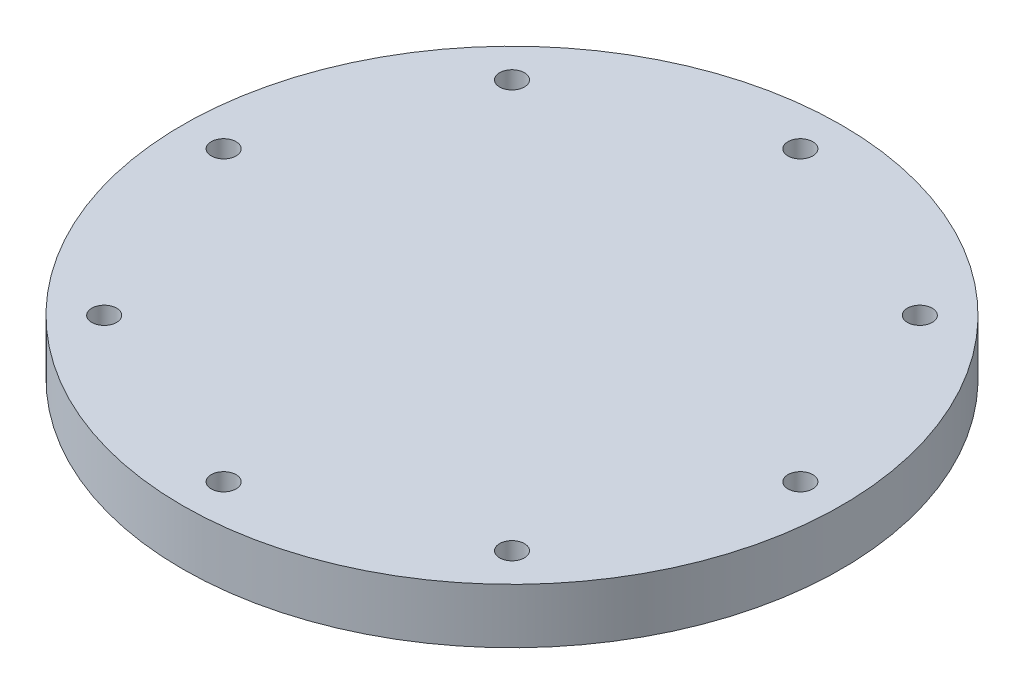
ISO-10303-21;
HEADER;
FILE_DESCRIPTION(('STEP AP214'),'2;1');
FILE_NAME('part.step','',(''),(''),'','','');
FILE_SCHEMA(('AUTOMOTIVE_DESIGN { 1 0 10303 214 1 1 1 1 }'));
ENDSEC;
DATA;
#1=APPLICATION_CONTEXT('core data for automotive mechanical design processes');
#2=APPLICATION_PROTOCOL_DEFINITION('international standard','automotive_design',2000,#1);
#3=PRODUCT_CONTEXT('',#1,'mechanical');
#4=PRODUCT('Part','Part','',(#3));
#5=PRODUCT_RELATED_PRODUCT_CATEGORY('part','',(#4));
#6=PRODUCT_DEFINITION_FORMATION('','',#4);
#7=PRODUCT_DEFINITION_CONTEXT('part definition',#1,'design');
#8=PRODUCT_DEFINITION('design','',#6,#7);
#9=PRODUCT_DEFINITION_SHAPE('','',#8);
#10=(LENGTH_UNIT() NAMED_UNIT(*) SI_UNIT(.MILLI.,.METRE.));
#11=(NAMED_UNIT(*) PLANE_ANGLE_UNIT() SI_UNIT($,.RADIAN.));
#12=(NAMED_UNIT(*) SI_UNIT($,.STERADIAN.) SOLID_ANGLE_UNIT());
#13=UNCERTAINTY_MEASURE_WITH_UNIT(LENGTH_MEASURE(1.E-05),#10,'distance_accuracy_value','');
#14=(GEOMETRIC_REPRESENTATION_CONTEXT(3) GLOBAL_UNCERTAINTY_ASSIGNED_CONTEXT((#13)) GLOBAL_UNIT_ASSIGNED_CONTEXT((#10,
#11,#12)) REPRESENTATION_CONTEXT('',''));
#15=CARTESIAN_POINT('',(0.,0.,0.));
#16=DIRECTION('',(0.,0.,1.));
#17=DIRECTION('',(1.,0.,0.));
#18=AXIS2_PLACEMENT_3D('',#15,#16,#17);
#19=CARTESIAN_POINT('',(0.,6.35,0.));
#20=DIRECTION('',(0.,1.,0.));
#21=DIRECTION('',(0.,0.,1.));
#22=AXIS2_PLACEMENT_3D('',#19,#20,#21);
#23=PLANE('',#22);
#24=CARTESIAN_POINT('',(0.,6.35,0.));
#25=DIRECTION('',(0.,1.,0.));
#26=DIRECTION('',(0.,0.,1.));
#27=AXIS2_PLACEMENT_3D('',#24,#25,#26);
#28=CIRCLE('',#27,38.1);
#29=CARTESIAN_POINT('',(0.,6.35,38.1));
#30=VERTEX_POINT('',#29);
#31=EDGE_CURVE('E10',#30,#30,#28,.T.);
#32=ORIENTED_EDGE('',*,*,#31,.T.);
#33=EDGE_LOOP('',(#32));
#34=FACE_BOUND('',#33,.T.);
#35=CARTESIAN_POINT('',(0.,6.35,33.3375));
#36=DIRECTION('',(0.,-1.,0.));
#37=DIRECTION('',(0.,0.,-1.));
#38=AXIS2_PLACEMENT_3D('',#35,#36,#37);
#39=CIRCLE('',#38,1.4351);
#40=CARTESIAN_POINT('',(0.,6.35,31.9024));
#41=VERTEX_POINT('',#40);
#42=EDGE_CURVE('E46',#41,#41,#39,.T.);
#43=ORIENTED_EDGE('',*,*,#42,.T.);
#44=EDGE_LOOP('',(#43));
#45=FACE_BOUND('',#44,.T.);
#46=CARTESIAN_POINT('',(23.5731723178066,6.35,23.5731723178065));
#47=DIRECTION('',(0.,-1.,0.));
#48=DIRECTION('',(0.,0.,-1.));
#49=AXIS2_PLACEMENT_3D('',#46,#47,#48);
#50=CIRCLE('',#49,1.4351);
#51=CARTESIAN_POINT('',(23.5731723178066,6.35,22.1380723178065));
#52=VERTEX_POINT('',#51);
#53=EDGE_CURVE('E59',#52,#52,#50,.T.);
#54=ORIENTED_EDGE('',*,*,#53,.T.);
#55=EDGE_LOOP('',(#54));
#56=FACE_BOUND('',#55,.T.);
#57=CARTESIAN_POINT('',(33.3375,6.35,-1.16397259133683E-13));
#58=DIRECTION('',(0.,-1.,0.));
#59=DIRECTION('',(0.,0.,-1.));
#60=AXIS2_PLACEMENT_3D('',#57,#58,#59);
#61=CIRCLE('',#60,1.4351);
#62=CARTESIAN_POINT('',(33.3375,6.35,-1.43510000000012));
#63=VERTEX_POINT('',#62);
#64=EDGE_CURVE('E71',#63,#63,#61,.T.);
#65=ORIENTED_EDGE('',*,*,#64,.T.);
#66=EDGE_LOOP('',(#65));
#67=FACE_BOUND('',#66,.T.);
#68=CARTESIAN_POINT('',(23.5731723178064,6.35,-23.5731723178067));
#69=DIRECTION('',(0.,-1.,0.));
#70=DIRECTION('',(0.,0.,-1.));
#71=AXIS2_PLACEMENT_3D('',#68,#69,#70);
#72=CIRCLE('',#71,1.4351);
#73=CARTESIAN_POINT('',(23.5731723178064,6.35,-25.0082723178067));
#74=VERTEX_POINT('',#73);
#75=EDGE_CURVE('E83',#74,#74,#72,.T.);
#76=ORIENTED_EDGE('',*,*,#75,.T.);
#77=EDGE_LOOP('',(#76));
#78=FACE_BOUND('',#77,.T.);
#79=CARTESIAN_POINT('',(0.,6.35,-33.3375));
#80=DIRECTION('',(0.,-1.,0.));
#81=DIRECTION('',(0.,0.,-1.));
#82=AXIS2_PLACEMENT_3D('',#79,#80,#81);
#83=CIRCLE('',#82,1.4351);
#84=CARTESIAN_POINT('',(0.,6.35,-34.7726));
#85=VERTEX_POINT('',#84);
#86=EDGE_CURVE('E95',#85,#85,#83,.T.);
#87=ORIENTED_EDGE('',*,*,#86,.T.);
#88=EDGE_LOOP('',(#87));
#89=FACE_BOUND('',#88,.T.);
#90=CARTESIAN_POINT('',(-23.5731723178067,6.35,-23.5731723178063));
#91=DIRECTION('',(0.,-1.,0.));
#92=DIRECTION('',(0.,0.,-1.));
#93=AXIS2_PLACEMENT_3D('',#90,#91,#92);
#94=CIRCLE('',#93,1.4351);
#95=CARTESIAN_POINT('',(-23.5731723178067,6.35,-25.0082723178063));
#96=VERTEX_POINT('',#95);
#97=EDGE_CURVE('E107',#96,#96,#94,.T.);
#98=ORIENTED_EDGE('',*,*,#97,.T.);
#99=EDGE_LOOP('',(#98));
#100=FACE_BOUND('',#99,.T.);
#101=CARTESIAN_POINT('',(-33.3375,6.35,3.49191777401049E-13));
#102=DIRECTION('',(0.,-1.,0.));
#103=DIRECTION('',(0.,0.,-1.));
#104=AXIS2_PLACEMENT_3D('',#101,#102,#103);
#105=CIRCLE('',#104,1.4351);
#106=CARTESIAN_POINT('',(-33.3375,6.35,-1.43509999999965));
#107=VERTEX_POINT('',#106);
#108=EDGE_CURVE('E119',#107,#107,#105,.T.);
#109=ORIENTED_EDGE('',*,*,#108,.T.);
#110=EDGE_LOOP('',(#109));
#111=FACE_BOUND('',#110,.T.);
#112=CARTESIAN_POINT('',(-23.5731723178062,6.35,23.5731723178068));
#113=DIRECTION('',(0.,-1.,0.));
#114=DIRECTION('',(0.,0.,-1.));
#115=AXIS2_PLACEMENT_3D('',#112,#113,#114);
#116=CIRCLE('',#115,1.4351);
#117=CARTESIAN_POINT('',(-23.5731723178062,6.35,22.1380723178068));
#118=VERTEX_POINT('',#117);
#119=EDGE_CURVE('E131',#118,#118,#116,.T.);
#120=ORIENTED_EDGE('',*,*,#119,.T.);
#121=EDGE_LOOP('',(#120));
#122=FACE_BOUND('',#121,.T.);
#123=ADVANCED_FACE('F35',(#34,#45,#56,#67,#78,#89,#100,#111,#122),#23,.T.);
#124=CARTESIAN_POINT('',(0.,0.,0.));
#125=DIRECTION('',(0.,1.,0.));
#126=DIRECTION('',(0.,0.,1.));
#127=AXIS2_PLACEMENT_3D('',#124,#125,#126);
#128=PLANE('',#127);
#129=CARTESIAN_POINT('',(-23.5731723178062,0.,23.5731723178068));
#130=DIRECTION('',(0.,-1.,0.));
#131=DIRECTION('',(0.,0.,-1.));
#132=AXIS2_PLACEMENT_3D('',#129,#130,#131);
#133=CIRCLE('',#132,2.413);
#134=CARTESIAN_POINT('',(-23.5731723178062,0.,21.1601723178068));
#135=VERTEX_POINT('',#134);
#136=EDGE_CURVE('E140',#135,#135,#133,.T.);
#137=ORIENTED_EDGE('',*,*,#136,.F.);
#138=EDGE_LOOP('',(#137));
#139=FACE_BOUND('',#138,.T.);
#140=CARTESIAN_POINT('',(-33.3375,0.,3.49191777401049E-13));
#141=DIRECTION('',(0.,-1.,0.));
#142=DIRECTION('',(0.,0.,-1.));
#143=AXIS2_PLACEMENT_3D('',#140,#141,#142);
#144=CIRCLE('',#143,2.413);
#145=CARTESIAN_POINT('',(-33.3375,0.,-2.41299999999965));
#146=VERTEX_POINT('',#145);
#147=EDGE_CURVE('E128',#146,#146,#144,.T.);
#148=ORIENTED_EDGE('',*,*,#147,.F.);
#149=EDGE_LOOP('',(#148));
#150=FACE_BOUND('',#149,.T.);
#151=CARTESIAN_POINT('',(-23.5731723178067,0.,-23.5731723178063));
#152=DIRECTION('',(0.,-1.,0.));
#153=DIRECTION('',(0.,0.,-1.));
#154=AXIS2_PLACEMENT_3D('',#151,#152,#153);
#155=CIRCLE('',#154,2.413);
#156=CARTESIAN_POINT('',(-23.5731723178067,0.,-25.9861723178063));
#157=VERTEX_POINT('',#156);
#158=EDGE_CURVE('E116',#157,#157,#155,.T.);
#159=ORIENTED_EDGE('',*,*,#158,.F.);
#160=EDGE_LOOP('',(#159));
#161=FACE_BOUND('',#160,.T.);
#162=CARTESIAN_POINT('',(23.5731723178064,0.,-23.5731723178067));
#163=DIRECTION('',(0.,-1.,0.));
#164=DIRECTION('',(0.,0.,-1.));
#165=AXIS2_PLACEMENT_3D('',#162,#163,#164);
#166=CIRCLE('',#165,2.413);
#167=CARTESIAN_POINT('',(23.5731723178064,0.,-25.9861723178067));
#168=VERTEX_POINT('',#167);
#169=EDGE_CURVE('E92',#168,#168,#166,.T.);
#170=ORIENTED_EDGE('',*,*,#169,.F.);
#171=EDGE_LOOP('',(#170));
#172=FACE_BOUND('',#171,.T.);
#173=CARTESIAN_POINT('',(33.3375,0.,-1.16397259133683E-13));
#174=DIRECTION('',(0.,-1.,0.));
#175=DIRECTION('',(0.,0.,-1.));
#176=AXIS2_PLACEMENT_3D('',#173,#174,#175);
#177=CIRCLE('',#176,2.413);
#178=CARTESIAN_POINT('',(33.3375,0.,-2.41300000000011));
#179=VERTEX_POINT('',#178);
#180=EDGE_CURVE('E80',#179,#179,#177,.T.);
#181=ORIENTED_EDGE('',*,*,#180,.F.);
#182=EDGE_LOOP('',(#181));
#183=FACE_BOUND('',#182,.T.);
#184=CARTESIAN_POINT('',(23.5731723178066,0.,23.5731723178065));
#185=DIRECTION('',(0.,-1.,0.));
#186=DIRECTION('',(0.,0.,-1.));
#187=AXIS2_PLACEMENT_3D('',#184,#185,#186);
#188=CIRCLE('',#187,2.413);
#189=CARTESIAN_POINT('',(23.5731723178066,0.,21.1601723178065));
#190=VERTEX_POINT('',#189);
#191=EDGE_CURVE('E68',#190,#190,#188,.T.);
#192=ORIENTED_EDGE('',*,*,#191,.F.);
#193=EDGE_LOOP('',(#192));
#194=FACE_BOUND('',#193,.T.);
#195=CARTESIAN_POINT('',(0.,0.,33.3375));
#196=DIRECTION('',(0.,-1.,0.));
#197=DIRECTION('',(0.,0.,-1.));
#198=AXIS2_PLACEMENT_3D('',#195,#196,#197);
#199=CIRCLE('',#198,2.413);
#200=CARTESIAN_POINT('',(0.,0.,30.9245));
#201=VERTEX_POINT('',#200);
#202=EDGE_CURVE('E56',#201,#201,#199,.T.);
#203=ORIENTED_EDGE('',*,*,#202,.F.);
#204=EDGE_LOOP('',(#203));
#205=FACE_BOUND('',#204,.T.);
#206=CARTESIAN_POINT('',(0.,0.,0.));
#207=DIRECTION('',(0.,1.,0.));
#208=DIRECTION('',(0.,0.,1.));
#209=AXIS2_PLACEMENT_3D('',#206,#207,#208);
#210=CIRCLE('',#209,38.1);
#211=CARTESIAN_POINT('',(0.,0.,38.1));
#212=VERTEX_POINT('',#211);
#213=EDGE_CURVE('E39',#212,#212,#210,.T.);
#214=ORIENTED_EDGE('',*,*,#213,.F.);
#215=EDGE_LOOP('',(#214));
#216=FACE_BOUND('',#215,.T.);
#217=CARTESIAN_POINT('',(0.,0.,-33.3375));
#218=DIRECTION('',(0.,-1.,0.));
#219=DIRECTION('',(0.,0.,-1.));
#220=AXIS2_PLACEMENT_3D('',#217,#218,#219);
#221=CIRCLE('',#220,2.413);
#222=CARTESIAN_POINT('',(0.,0.,-35.7505));
#223=VERTEX_POINT('',#222);
#224=EDGE_CURVE('E104',#223,#223,#221,.T.);
#225=ORIENTED_EDGE('',*,*,#224,.F.);
#226=EDGE_LOOP('',(#225));
#227=FACE_BOUND('',#226,.T.);
#228=ADVANCED_FACE('F146',(#139,#150,#161,#172,#183,#194,#205,#216,#227),#128,.F.);
#229=CARTESIAN_POINT('',(0.,6.35,0.));
#230=DIRECTION('',(0.,-1.,0.));
#231=DIRECTION('',(0.,0.,-1.));
#232=AXIS2_PLACEMENT_3D('',#229,#230,#231);
#233=CYLINDRICAL_SURFACE('',#232,38.1);
#234=ORIENTED_EDGE('',*,*,#31,.F.);
#235=EDGE_LOOP('',(#234));
#236=FACE_BOUND('',#235,.T.);
#237=ORIENTED_EDGE('',*,*,#213,.T.);
#238=EDGE_LOOP('',(#237));
#239=FACE_BOUND('',#238,.T.);
#240=ADVANCED_FACE('F37',(#236,#239),#233,.T.);
#241=CARTESIAN_POINT('',(0.,0.,33.3375));
#242=DIRECTION('',(0.,-1.,0.));
#243=DIRECTION('',(0.,0.,-1.));
#244=AXIS2_PLACEMENT_3D('',#241,#242,#243);
#245=CYLINDRICAL_SURFACE('',#244,1.4351);
#246=ORIENTED_EDGE('',*,*,#42,.F.);
#247=EDGE_LOOP('',(#246));
#248=FACE_BOUND('',#247,.T.);
#249=CARTESIAN_POINT('',(0.,3.175,33.3375));
#250=DIRECTION('',(0.,-1.,0.));
#251=DIRECTION('',(0.,0.,-1.));
#252=AXIS2_PLACEMENT_3D('',#249,#250,#251);
#253=CIRCLE('',#252,1.4351);
#254=CARTESIAN_POINT('',(0.,3.175,31.9024));
#255=VERTEX_POINT('',#254);
#256=EDGE_CURVE('E50',#255,#255,#253,.T.);
#257=ORIENTED_EDGE('',*,*,#256,.T.);
#258=EDGE_LOOP('',(#257));
#259=FACE_BOUND('',#258,.T.);
#260=ADVANCED_FACE('F188',(#248,#259),#245,.F.);
#261=CARTESIAN_POINT('',(1.4351,3.175,33.3375));
#262=DIRECTION('',(0.,1.,0.));
#263=DIRECTION('',(0.,0.,1.));
#264=AXIS2_PLACEMENT_3D('',#261,#262,#263);
#265=PLANE('',#264);
#266=ORIENTED_EDGE('',*,*,#256,.F.);
#267=EDGE_LOOP('',(#266));
#268=FACE_BOUND('',#267,.T.);
#269=CARTESIAN_POINT('',(0.,3.175,33.3375));
#270=DIRECTION('',(0.,-1.,0.));
#271=DIRECTION('',(0.,0.,-1.));
#272=AXIS2_PLACEMENT_3D('',#269,#270,#271);
#273=CIRCLE('',#272,2.413);
#274=CARTESIAN_POINT('',(0.,3.175,30.9245));
#275=VERTEX_POINT('',#274);
#276=EDGE_CURVE('E53',#275,#275,#273,.T.);
#277=ORIENTED_EDGE('',*,*,#276,.T.);
#278=EDGE_LOOP('',(#277));
#279=FACE_BOUND('',#278,.T.);
#280=ADVANCED_FACE('F191',(#268,#279),#265,.F.);
#281=CARTESIAN_POINT('',(0.,0.,33.3375));
#282=DIRECTION('',(0.,-1.,0.));
#283=DIRECTION('',(0.,0.,-1.));
#284=AXIS2_PLACEMENT_3D('',#281,#282,#283);
#285=CYLINDRICAL_SURFACE('',#284,2.413);
#286=ORIENTED_EDGE('',*,*,#276,.F.);
#287=EDGE_LOOP('',(#286));
#288=FACE_BOUND('',#287,.T.);
#289=ORIENTED_EDGE('',*,*,#202,.T.);
#290=EDGE_LOOP('',(#289));
#291=FACE_BOUND('',#290,.T.);
#292=ADVANCED_FACE('F195',(#288,#291),#285,.F.);
#293=CARTESIAN_POINT('',(23.5731723178066,0.,23.5731723178065));
#294=DIRECTION('',(0.,-1.,0.));
#295=DIRECTION('',(0.,0.,-1.));
#296=AXIS2_PLACEMENT_3D('',#293,#294,#295);
#297=CYLINDRICAL_SURFACE('',#296,1.4351);
#298=ORIENTED_EDGE('',*,*,#53,.F.);
#299=EDGE_LOOP('',(#298));
#300=FACE_BOUND('',#299,.T.);
#301=CARTESIAN_POINT('',(23.5731723178066,3.175,23.5731723178065));
#302=DIRECTION('',(0.,-1.,0.));
#303=DIRECTION('',(0.,0.,-1.));
#304=AXIS2_PLACEMENT_3D('',#301,#302,#303);
#305=CIRCLE('',#304,1.4351);
#306=CARTESIAN_POINT('',(23.5731723178066,3.175,22.1380723178065));
#307=VERTEX_POINT('',#306);
#308=EDGE_CURVE('E62',#307,#307,#305,.T.);
#309=ORIENTED_EDGE('',*,*,#308,.T.);
#310=EDGE_LOOP('',(#309));
#311=FACE_BOUND('',#310,.T.);
#312=ADVANCED_FACE('F199',(#300,#311),#297,.F.);
#313=CARTESIAN_POINT('',(25.0082723178066,3.175,23.5731723178065));
#314=DIRECTION('',(0.,1.,0.));
#315=DIRECTION('',(0.,0.,1.));
#316=AXIS2_PLACEMENT_3D('',#313,#314,#315);
#317=PLANE('',#316);
#318=ORIENTED_EDGE('',*,*,#308,.F.);
#319=EDGE_LOOP('',(#318));
#320=FACE_BOUND('',#319,.T.);
#321=CARTESIAN_POINT('',(23.5731723178066,3.175,23.5731723178065));
#322=DIRECTION('',(0.,-1.,0.));
#323=DIRECTION('',(0.,0.,-1.));
#324=AXIS2_PLACEMENT_3D('',#321,#322,#323);
#325=CIRCLE('',#324,2.413);
#326=CARTESIAN_POINT('',(23.5731723178066,3.175,21.1601723178065));
#327=VERTEX_POINT('',#326);
#328=EDGE_CURVE('E65',#327,#327,#325,.T.);
#329=ORIENTED_EDGE('',*,*,#328,.T.);
#330=EDGE_LOOP('',(#329));
#331=FACE_BOUND('',#330,.T.);
#332=ADVANCED_FACE('F203',(#320,#331),#317,.F.);
#333=CARTESIAN_POINT('',(23.5731723178066,0.,23.5731723178065));
#334=DIRECTION('',(0.,-1.,0.));
#335=DIRECTION('',(0.,0.,-1.));
#336=AXIS2_PLACEMENT_3D('',#333,#334,#335);
#337=CYLINDRICAL_SURFACE('',#336,2.413);
#338=ORIENTED_EDGE('',*,*,#328,.F.);
#339=EDGE_LOOP('',(#338));
#340=FACE_BOUND('',#339,.T.);
#341=ORIENTED_EDGE('',*,*,#191,.T.);
#342=EDGE_LOOP('',(#341));
#343=FACE_BOUND('',#342,.T.);
#344=ADVANCED_FACE('F207',(#340,#343),#337,.F.);
#345=CARTESIAN_POINT('',(33.3375,0.,-1.16397259133683E-13));
#346=DIRECTION('',(0.,-1.,0.));
#347=DIRECTION('',(0.,0.,-1.));
#348=AXIS2_PLACEMENT_3D('',#345,#346,#347);
#349=CYLINDRICAL_SURFACE('',#348,1.4351);
#350=ORIENTED_EDGE('',*,*,#64,.F.);
#351=EDGE_LOOP('',(#350));
#352=FACE_BOUND('',#351,.T.);
#353=CARTESIAN_POINT('',(33.3375,3.175,-1.16397259133683E-13));
#354=DIRECTION('',(0.,-1.,0.));
#355=DIRECTION('',(0.,0.,-1.));
#356=AXIS2_PLACEMENT_3D('',#353,#354,#355);
#357=CIRCLE('',#356,1.4351);
#358=CARTESIAN_POINT('',(33.3375,3.175,-1.43510000000012));
#359=VERTEX_POINT('',#358);
#360=EDGE_CURVE('E74',#359,#359,#357,.T.);
#361=ORIENTED_EDGE('',*,*,#360,.T.);
#362=EDGE_LOOP('',(#361));
#363=FACE_BOUND('',#362,.T.);
#364=ADVANCED_FACE('F211',(#352,#363),#349,.F.);
#365=CARTESIAN_POINT('',(34.7726,3.175,-1.16397259133683E-13));
#366=DIRECTION('',(0.,1.,0.));
#367=DIRECTION('',(0.,0.,1.));
#368=AXIS2_PLACEMENT_3D('',#365,#366,#367);
#369=PLANE('',#368);
#370=ORIENTED_EDGE('',*,*,#360,.F.);
#371=EDGE_LOOP('',(#370));
#372=FACE_BOUND('',#371,.T.);
#373=CARTESIAN_POINT('',(33.3375,3.175,-1.16397259133683E-13));
#374=DIRECTION('',(0.,-1.,0.));
#375=DIRECTION('',(0.,0.,-1.));
#376=AXIS2_PLACEMENT_3D('',#373,#374,#375);
#377=CIRCLE('',#376,2.413);
#378=CARTESIAN_POINT('',(33.3375,3.175,-2.41300000000011));
#379=VERTEX_POINT('',#378);
#380=EDGE_CURVE('E77',#379,#379,#377,.T.);
#381=ORIENTED_EDGE('',*,*,#380,.T.);
#382=EDGE_LOOP('',(#381));
#383=FACE_BOUND('',#382,.T.);
#384=ADVANCED_FACE('F215',(#372,#383),#369,.F.);
#385=CARTESIAN_POINT('',(33.3375,0.,-1.16397259133683E-13));
#386=DIRECTION('',(0.,-1.,0.));
#387=DIRECTION('',(0.,0.,-1.));
#388=AXIS2_PLACEMENT_3D('',#385,#386,#387);
#389=CYLINDRICAL_SURFACE('',#388,2.413);
#390=ORIENTED_EDGE('',*,*,#380,.F.);
#391=EDGE_LOOP('',(#390));
#392=FACE_BOUND('',#391,.T.);
#393=ORIENTED_EDGE('',*,*,#180,.T.);
#394=EDGE_LOOP('',(#393));
#395=FACE_BOUND('',#394,.T.);
#396=ADVANCED_FACE('F219',(#392,#395),#389,.F.);
#397=CARTESIAN_POINT('',(23.5731723178064,0.,-23.5731723178067));
#398=DIRECTION('',(0.,-1.,0.));
#399=DIRECTION('',(0.,0.,-1.));
#400=AXIS2_PLACEMENT_3D('',#397,#398,#399);
#401=CYLINDRICAL_SURFACE('',#400,1.4351);
#402=ORIENTED_EDGE('',*,*,#75,.F.);
#403=EDGE_LOOP('',(#402));
#404=FACE_BOUND('',#403,.T.);
#405=CARTESIAN_POINT('',(23.5731723178064,3.175,-23.5731723178067));
#406=DIRECTION('',(0.,-1.,0.));
#407=DIRECTION('',(0.,0.,-1.));
#408=AXIS2_PLACEMENT_3D('',#405,#406,#407);
#409=CIRCLE('',#408,1.4351);
#410=CARTESIAN_POINT('',(23.5731723178064,3.175,-25.0082723178067));
#411=VERTEX_POINT('',#410);
#412=EDGE_CURVE('E86',#411,#411,#409,.T.);
#413=ORIENTED_EDGE('',*,*,#412,.T.);
#414=EDGE_LOOP('',(#413));
#415=FACE_BOUND('',#414,.T.);
#416=ADVANCED_FACE('F223',(#404,#415),#401,.F.);
#417=CARTESIAN_POINT('',(25.0082723178064,3.175,-23.5731723178067));
#418=DIRECTION('',(0.,1.,0.));
#419=DIRECTION('',(0.,0.,1.));
#420=AXIS2_PLACEMENT_3D('',#417,#418,#419);
#421=PLANE('',#420);
#422=ORIENTED_EDGE('',*,*,#412,.F.);
#423=EDGE_LOOP('',(#422));
#424=FACE_BOUND('',#423,.T.);
#425=CARTESIAN_POINT('',(23.5731723178064,3.175,-23.5731723178067));
#426=DIRECTION('',(0.,-1.,0.));
#427=DIRECTION('',(0.,0.,-1.));
#428=AXIS2_PLACEMENT_3D('',#425,#426,#427);
#429=CIRCLE('',#428,2.413);
#430=CARTESIAN_POINT('',(23.5731723178064,3.175,-25.9861723178067));
#431=VERTEX_POINT('',#430);
#432=EDGE_CURVE('E89',#431,#431,#429,.T.);
#433=ORIENTED_EDGE('',*,*,#432,.T.);
#434=EDGE_LOOP('',(#433));
#435=FACE_BOUND('',#434,.T.);
#436=ADVANCED_FACE('F227',(#424,#435),#421,.F.);
#437=CARTESIAN_POINT('',(23.5731723178064,0.,-23.5731723178067));
#438=DIRECTION('',(0.,-1.,0.));
#439=DIRECTION('',(0.,0.,-1.));
#440=AXIS2_PLACEMENT_3D('',#437,#438,#439);
#441=CYLINDRICAL_SURFACE('',#440,2.413);
#442=ORIENTED_EDGE('',*,*,#432,.F.);
#443=EDGE_LOOP('',(#442));
#444=FACE_BOUND('',#443,.T.);
#445=ORIENTED_EDGE('',*,*,#169,.T.);
#446=EDGE_LOOP('',(#445));
#447=FACE_BOUND('',#446,.T.);
#448=ADVANCED_FACE('F231',(#444,#447),#441,.F.);
#449=CARTESIAN_POINT('',(0.,0.,-33.3375));
#450=DIRECTION('',(0.,-1.,0.));
#451=DIRECTION('',(0.,0.,-1.));
#452=AXIS2_PLACEMENT_3D('',#449,#450,#451);
#453=CYLINDRICAL_SURFACE('',#452,1.4351);
#454=ORIENTED_EDGE('',*,*,#86,.F.);
#455=EDGE_LOOP('',(#454));
#456=FACE_BOUND('',#455,.T.);
#457=CARTESIAN_POINT('',(0.,3.175,-33.3375));
#458=DIRECTION('',(0.,-1.,0.));
#459=DIRECTION('',(0.,0.,-1.));
#460=AXIS2_PLACEMENT_3D('',#457,#458,#459);
#461=CIRCLE('',#460,1.4351);
#462=CARTESIAN_POINT('',(0.,3.175,-34.7726));
#463=VERTEX_POINT('',#462);
#464=EDGE_CURVE('E98',#463,#463,#461,.T.);
#465=ORIENTED_EDGE('',*,*,#464,.T.);
#466=EDGE_LOOP('',(#465));
#467=FACE_BOUND('',#466,.T.);
#468=ADVANCED_FACE('F178',(#456,#467),#453,.F.);
#469=CARTESIAN_POINT('',(1.4351,3.175,-33.3375));
#470=DIRECTION('',(0.,1.,0.));
#471=DIRECTION('',(0.,0.,1.));
#472=AXIS2_PLACEMENT_3D('',#469,#470,#471);
#473=PLANE('',#472);
#474=ORIENTED_EDGE('',*,*,#464,.F.);
#475=EDGE_LOOP('',(#474));
#476=FACE_BOUND('',#475,.T.);
#477=CARTESIAN_POINT('',(0.,3.175,-33.3375));
#478=DIRECTION('',(0.,-1.,0.));
#479=DIRECTION('',(0.,0.,-1.));
#480=AXIS2_PLACEMENT_3D('',#477,#478,#479);
#481=CIRCLE('',#480,2.413);
#482=CARTESIAN_POINT('',(0.,3.175,-35.7505));
#483=VERTEX_POINT('',#482);
#484=EDGE_CURVE('E101',#483,#483,#481,.T.);
#485=ORIENTED_EDGE('',*,*,#484,.T.);
#486=EDGE_LOOP('',(#485));
#487=FACE_BOUND('',#486,.T.);
#488=ADVANCED_FACE('F168',(#476,#487),#473,.F.);
#489=CARTESIAN_POINT('',(0.,0.,-33.3375));
#490=DIRECTION('',(0.,-1.,0.));
#491=DIRECTION('',(0.,0.,-1.));
#492=AXIS2_PLACEMENT_3D('',#489,#490,#491);
#493=CYLINDRICAL_SURFACE('',#492,2.413);
#494=ORIENTED_EDGE('',*,*,#484,.F.);
#495=EDGE_LOOP('',(#494));
#496=FACE_BOUND('',#495,.T.);
#497=ORIENTED_EDGE('',*,*,#224,.T.);
#498=EDGE_LOOP('',(#497));
#499=FACE_BOUND('',#498,.T.);
#500=ADVANCED_FACE('F165',(#496,#499),#493,.F.);
#501=CARTESIAN_POINT('',(-23.5731723178067,0.,-23.5731723178063));
#502=DIRECTION('',(0.,-1.,0.));
#503=DIRECTION('',(0.,0.,-1.));
#504=AXIS2_PLACEMENT_3D('',#501,#502,#503);
#505=CYLINDRICAL_SURFACE('',#504,1.4351);
#506=ORIENTED_EDGE('',*,*,#97,.F.);
#507=EDGE_LOOP('',(#506));
#508=FACE_BOUND('',#507,.T.);
#509=CARTESIAN_POINT('',(-23.5731723178067,3.175,-23.5731723178063));
#510=DIRECTION('',(0.,-1.,0.));
#511=DIRECTION('',(0.,0.,-1.));
#512=AXIS2_PLACEMENT_3D('',#509,#510,#511);
#513=CIRCLE('',#512,1.4351);
#514=CARTESIAN_POINT('',(-23.5731723178067,3.175,-25.0082723178063));
#515=VERTEX_POINT('',#514);
#516=EDGE_CURVE('E110',#515,#515,#513,.T.);
#517=ORIENTED_EDGE('',*,*,#516,.T.);
#518=EDGE_LOOP('',(#517));
#519=FACE_BOUND('',#518,.T.);
#520=ADVANCED_FACE('F167',(#508,#519),#505,.F.);
#521=CARTESIAN_POINT('',(-22.1380723178067,3.175,-23.5731723178063));
#522=DIRECTION('',(0.,1.,0.));
#523=DIRECTION('',(0.,0.,1.));
#524=AXIS2_PLACEMENT_3D('',#521,#522,#523);
#525=PLANE('',#524);
#526=ORIENTED_EDGE('',*,*,#516,.F.);
#527=EDGE_LOOP('',(#526));
#528=FACE_BOUND('',#527,.T.);
#529=CARTESIAN_POINT('',(-23.5731723178067,3.175,-23.5731723178063));
#530=DIRECTION('',(0.,-1.,0.));
#531=DIRECTION('',(0.,0.,-1.));
#532=AXIS2_PLACEMENT_3D('',#529,#530,#531);
#533=CIRCLE('',#532,2.413);
#534=CARTESIAN_POINT('',(-23.5731723178067,3.175,-25.9861723178063));
#535=VERTEX_POINT('',#534);
#536=EDGE_CURVE('E113',#535,#535,#533,.T.);
#537=ORIENTED_EDGE('',*,*,#536,.T.);
#538=EDGE_LOOP('',(#537));
#539=FACE_BOUND('',#538,.T.);
#540=ADVANCED_FACE('F175',(#528,#539),#525,.F.);
#541=CARTESIAN_POINT('',(-23.5731723178067,0.,-23.5731723178063));
#542=DIRECTION('',(0.,-1.,0.));
#543=DIRECTION('',(0.,0.,-1.));
#544=AXIS2_PLACEMENT_3D('',#541,#542,#543);
#545=CYLINDRICAL_SURFACE('',#544,2.413);
#546=ORIENTED_EDGE('',*,*,#536,.F.);
#547=EDGE_LOOP('',(#546));
#548=FACE_BOUND('',#547,.T.);
#549=ORIENTED_EDGE('',*,*,#158,.T.);
#550=EDGE_LOOP('',(#549));
#551=FACE_BOUND('',#550,.T.);
#552=ADVANCED_FACE('F280',(#548,#551),#545,.F.);
#553=CARTESIAN_POINT('',(-33.3375,0.,3.49191777401049E-13));
#554=DIRECTION('',(0.,-1.,0.));
#555=DIRECTION('',(0.,0.,-1.));
#556=AXIS2_PLACEMENT_3D('',#553,#554,#555);
#557=CYLINDRICAL_SURFACE('',#556,1.4351);
#558=ORIENTED_EDGE('',*,*,#108,.F.);
#559=EDGE_LOOP('',(#558));
#560=FACE_BOUND('',#559,.T.);
#561=CARTESIAN_POINT('',(-33.3375,3.175,3.49191777401049E-13));
#562=DIRECTION('',(0.,-1.,0.));
#563=DIRECTION('',(0.,0.,-1.));
#564=AXIS2_PLACEMENT_3D('',#561,#562,#563);
#565=CIRCLE('',#564,1.4351);
#566=CARTESIAN_POINT('',(-33.3375,3.175,-1.43509999999965));
#567=VERTEX_POINT('',#566);
#568=EDGE_CURVE('E122',#567,#567,#565,.T.);
#569=ORIENTED_EDGE('',*,*,#568,.T.);
#570=EDGE_LOOP('',(#569));
#571=FACE_BOUND('',#570,.T.);
#572=ADVANCED_FACE('F276',(#560,#571),#557,.F.);
#573=CARTESIAN_POINT('',(-31.9024,3.175,3.49191777401049E-13));
#574=DIRECTION('',(0.,1.,0.));
#575=DIRECTION('',(0.,0.,1.));
#576=AXIS2_PLACEMENT_3D('',#573,#574,#575);
#577=PLANE('',#576);
#578=ORIENTED_EDGE('',*,*,#568,.F.);
#579=EDGE_LOOP('',(#578));
#580=FACE_BOUND('',#579,.T.);
#581=CARTESIAN_POINT('',(-33.3375,3.175,3.49191777401049E-13));
#582=DIRECTION('',(0.,-1.,0.));
#583=DIRECTION('',(0.,0.,-1.));
#584=AXIS2_PLACEMENT_3D('',#581,#582,#583);
#585=CIRCLE('',#584,2.413);
#586=CARTESIAN_POINT('',(-33.3375,3.175,-2.41299999999965));
#587=VERTEX_POINT('',#586);
#588=EDGE_CURVE('E125',#587,#587,#585,.T.);
#589=ORIENTED_EDGE('',*,*,#588,.T.);
#590=EDGE_LOOP('',(#589));
#591=FACE_BOUND('',#590,.T.);
#592=ADVANCED_FACE('F272',(#580,#591),#577,.F.);
#593=CARTESIAN_POINT('',(-33.3375,0.,3.49191777401049E-13));
#594=DIRECTION('',(0.,-1.,0.));
#595=DIRECTION('',(0.,0.,-1.));
#596=AXIS2_PLACEMENT_3D('',#593,#594,#595);
#597=CYLINDRICAL_SURFACE('',#596,2.413);
#598=ORIENTED_EDGE('',*,*,#588,.F.);
#599=EDGE_LOOP('',(#598));
#600=FACE_BOUND('',#599,.T.);
#601=ORIENTED_EDGE('',*,*,#147,.T.);
#602=EDGE_LOOP('',(#601));
#603=FACE_BOUND('',#602,.T.);
#604=ADVANCED_FACE('F256',(#600,#603),#597,.F.);
#605=CARTESIAN_POINT('',(-23.5731723178062,0.,23.5731723178068));
#606=DIRECTION('',(0.,-1.,0.));
#607=DIRECTION('',(0.,0.,-1.));
#608=AXIS2_PLACEMENT_3D('',#605,#606,#607);
#609=CYLINDRICAL_SURFACE('',#608,1.4351);
#610=ORIENTED_EDGE('',*,*,#119,.F.);
#611=EDGE_LOOP('',(#610));
#612=FACE_BOUND('',#611,.T.);
#613=CARTESIAN_POINT('',(-23.5731723178062,3.175,23.5731723178068));
#614=DIRECTION('',(0.,-1.,0.));
#615=DIRECTION('',(0.,0.,-1.));
#616=AXIS2_PLACEMENT_3D('',#613,#614,#615);
#617=CIRCLE('',#616,1.4351);
#618=CARTESIAN_POINT('',(-23.5731723178062,3.175,22.1380723178068));
#619=VERTEX_POINT('',#618);
#620=EDGE_CURVE('E134',#619,#619,#617,.T.);
#621=ORIENTED_EDGE('',*,*,#620,.T.);
#622=EDGE_LOOP('',(#621));
#623=FACE_BOUND('',#622,.T.);
#624=ADVANCED_FACE('F252',(#612,#623),#609,.F.);
#625=CARTESIAN_POINT('',(-22.1380723178062,3.175,23.5731723178068));
#626=DIRECTION('',(0.,1.,0.));
#627=DIRECTION('',(0.,0.,1.));
#628=AXIS2_PLACEMENT_3D('',#625,#626,#627);
#629=PLANE('',#628);
#630=ORIENTED_EDGE('',*,*,#620,.F.);
#631=EDGE_LOOP('',(#630));
#632=FACE_BOUND('',#631,.T.);
#633=CARTESIAN_POINT('',(-23.5731723178062,3.175,23.5731723178068));
#634=DIRECTION('',(0.,-1.,0.));
#635=DIRECTION('',(0.,0.,-1.));
#636=AXIS2_PLACEMENT_3D('',#633,#634,#635);
#637=CIRCLE('',#636,2.413);
#638=CARTESIAN_POINT('',(-23.5731723178062,3.175,21.1601723178068));
#639=VERTEX_POINT('',#638);
#640=EDGE_CURVE('E137',#639,#639,#637,.T.);
#641=ORIENTED_EDGE('',*,*,#640,.T.);
#642=EDGE_LOOP('',(#641));
#643=FACE_BOUND('',#642,.T.);
#644=ADVANCED_FACE('F255',(#632,#643),#629,.F.);
#645=CARTESIAN_POINT('',(-23.5731723178062,0.,23.5731723178068));
#646=DIRECTION('',(0.,-1.,0.));
#647=DIRECTION('',(0.,0.,-1.));
#648=AXIS2_PLACEMENT_3D('',#645,#646,#647);
#649=CYLINDRICAL_SURFACE('',#648,2.413);
#650=ORIENTED_EDGE('',*,*,#640,.F.);
#651=EDGE_LOOP('',(#650));
#652=FACE_BOUND('',#651,.T.);
#653=ORIENTED_EDGE('',*,*,#136,.T.);
#654=EDGE_LOOP('',(#653));
#655=FACE_BOUND('',#654,.T.);
#656=ADVANCED_FACE('F144',(#652,#655),#649,.F.);
#657=CLOSED_SHELL('',(#123,#228,#240,#260,#280,#292,#312,#332,#344,#364,#384,#396,#416,#436,
#448,#468,#488,#500,#520,#540,#552,#572,#592,#604,#624,#644,#656));
#658=MANIFOLD_SOLID_BREP('B2',#657);
#659=ADVANCED_BREP_SHAPE_REPRESENTATION('',(#18,#658),#14);
#660=SHAPE_DEFINITION_REPRESENTATION(#9,#659);
ENDSEC;
END-ISO-10303-21;
